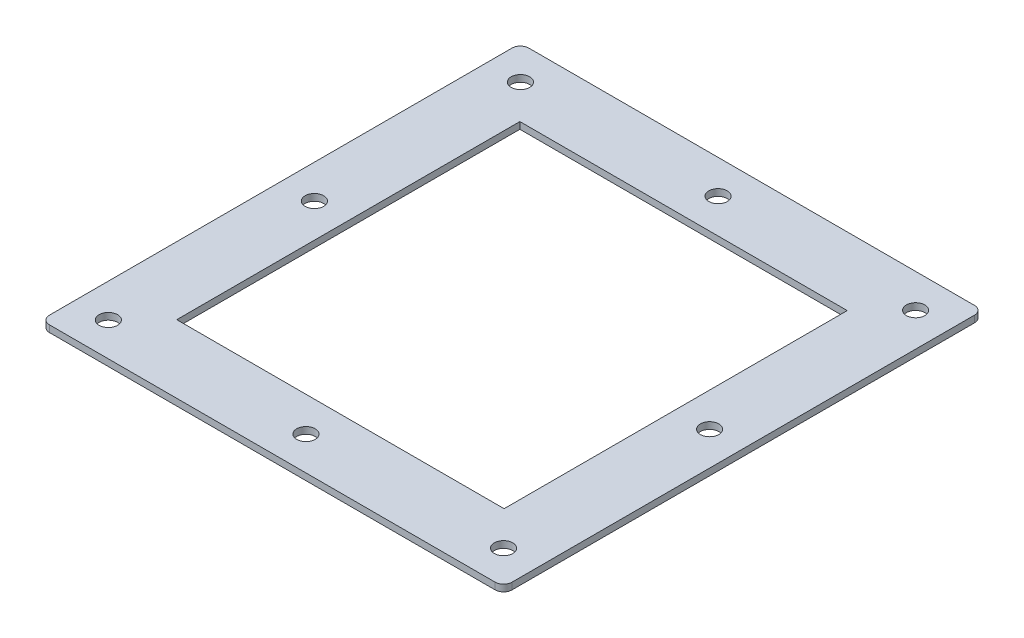
ISO-10303-21;
HEADER;
FILE_DESCRIPTION(('STEP AP214'),'2;1');
FILE_NAME('part.step','',(''),(''),'','','');
FILE_SCHEMA(('AUTOMOTIVE_DESIGN { 1 0 10303 214 1 1 1 1 }'));
ENDSEC;
DATA;
#1=APPLICATION_CONTEXT('core data for automotive mechanical design processes');
#2=APPLICATION_PROTOCOL_DEFINITION('international standard','automotive_design',2000,#1);
#3=PRODUCT_CONTEXT('',#1,'mechanical');
#4=PRODUCT('Part','Part','',(#3));
#5=PRODUCT_RELATED_PRODUCT_CATEGORY('part','',(#4));
#6=PRODUCT_DEFINITION_FORMATION('','',#4);
#7=PRODUCT_DEFINITION_CONTEXT('part definition',#1,'design');
#8=PRODUCT_DEFINITION('design','',#6,#7);
#9=PRODUCT_DEFINITION_SHAPE('','',#8);
#10=(LENGTH_UNIT() NAMED_UNIT(*) SI_UNIT(.MILLI.,.METRE.));
#11=(NAMED_UNIT(*) PLANE_ANGLE_UNIT() SI_UNIT($,.RADIAN.));
#12=(NAMED_UNIT(*) SI_UNIT($,.STERADIAN.) SOLID_ANGLE_UNIT());
#13=UNCERTAINTY_MEASURE_WITH_UNIT(LENGTH_MEASURE(1.E-05),#10,'distance_accuracy_value','');
#14=(GEOMETRIC_REPRESENTATION_CONTEXT(3) GLOBAL_UNCERTAINTY_ASSIGNED_CONTEXT((#13)) GLOBAL_UNIT_ASSIGNED_CONTEXT((#10,
#11,#12)) REPRESENTATION_CONTEXT('',''));
#15=CARTESIAN_POINT('',(0.,0.,0.));
#16=DIRECTION('',(0.,0.,1.));
#17=DIRECTION('',(1.,0.,0.));
#18=AXIS2_PLACEMENT_3D('',#15,#16,#17);
#19=CARTESIAN_POINT('',(-193.151037261948,344.875447906096,-102.00000000458));
#20=DIRECTION('',(0.,0.,1.));
#21=DIRECTION('',(1.,0.,0.));
#22=AXIS2_PLACEMENT_3D('',#19,#20,#21);
#23=PLANE('',#22);
#24=DIRECTION('',(0.,1.,0.));
#25=VECTOR('',#24,1.);
#26=CARTESIAN_POINT('',(-193.151037261948,344.875447906096,-102.00000000458));
#27=LINE('',#26,#25);
#28=CARTESIAN_POINT('',(-193.151037261948,340.875447906096,-102.00000000458));
#29=VERTEX_POINT('',#28);
#30=CARTESIAN_POINT('',(-193.151037261948,344.875447906096,-102.00000000458));
#31=VERTEX_POINT('',#30);
#32=EDGE_CURVE('E170',#29,#31,#27,.T.);
#33=ORIENTED_EDGE('',*,*,#32,.F.);
#34=DIRECTION('',(1.,0.,0.));
#35=VECTOR('',#34,1.);
#36=CARTESIAN_POINT('',(0.,340.875447906096,-102.00000000458));
#37=LINE('',#36,#35);
#38=CARTESIAN_POINT('',(1.49007185935127,340.875447906096,-102.00000000458));
#39=VERTEX_POINT('',#38);
#40=EDGE_CURVE('E216',#29,#39,#37,.T.);
#41=ORIENTED_EDGE('',*,*,#40,.T.);
#42=DIRECTION('',(0.,1.,0.));
#43=VECTOR('',#42,1.);
#44=CARTESIAN_POINT('',(1.49007185935127,344.875447906096,-102.00000000458));
#45=LINE('',#44,#43);
#46=CARTESIAN_POINT('',(1.49007185935127,344.875447906096,-102.00000000458));
#47=VERTEX_POINT('',#46);
#48=EDGE_CURVE('E233',#39,#47,#45,.T.);
#49=ORIENTED_EDGE('',*,*,#48,.T.);
#50=DIRECTION('',(1.,0.,0.));
#51=VECTOR('',#50,1.);
#52=CARTESIAN_POINT('',(-193.151037261948,344.875447906096,-102.00000000458));
#53=LINE('',#52,#51);
#54=EDGE_CURVE('E171',#31,#47,#53,.T.);
#55=ORIENTED_EDGE('',*,*,#54,.F.);
#56=EDGE_LOOP('',(#33,#41,#49,#55));
#57=FACE_BOUND('',#56,.T.);
#58=ADVANCED_FACE('F54',(#57),#23,.T.);
#59=CARTESIAN_POINT('',(1.49007185935127,344.875447906096,-102.00000000458));
#60=DIRECTION('',(-1.,0.,0.));
#61=DIRECTION('',(0.,0.,1.));
#62=AXIS2_PLACEMENT_3D('',#59,#60,#61);
#63=PLANE('',#62);
#64=ORIENTED_EDGE('',*,*,#48,.F.);
#65=DIRECTION('',(0.,0.,1.));
#66=VECTOR('',#65,1.);
#67=CARTESIAN_POINT('',(1.49007185935127,340.875447906096,0.));
#68=LINE('',#67,#66);
#69=CARTESIAN_POINT('',(1.49007185935125,340.875447906096,101.999999995405));
#70=VERTEX_POINT('',#69);
#71=EDGE_CURVE('E212',#39,#70,#68,.T.);
#72=ORIENTED_EDGE('',*,*,#71,.T.);
#73=DIRECTION('',(0.,1.,0.));
#74=VECTOR('',#73,1.);
#75=CARTESIAN_POINT('',(1.49007185935125,344.875447906096,101.999999995405));
#76=LINE('',#75,#74);
#77=CARTESIAN_POINT('',(1.49007185935125,344.875447906096,101.999999995405));
#78=VERTEX_POINT('',#77);
#79=EDGE_CURVE('E155',#70,#78,#76,.T.);
#80=ORIENTED_EDGE('',*,*,#79,.T.);
#81=DIRECTION('',(0.,0.,1.));
#82=VECTOR('',#81,1.);
#83=CARTESIAN_POINT('',(1.49007185935127,344.875447906096,-102.00000000458));
#84=LINE('',#83,#82);
#85=EDGE_CURVE('E166',#47,#78,#84,.T.);
#86=ORIENTED_EDGE('',*,*,#85,.F.);
#87=EDGE_LOOP('',(#64,#72,#80,#86));
#88=FACE_BOUND('',#87,.T.);
#89=ADVANCED_FACE('F347',(#88),#63,.T.);
#90=CARTESIAN_POINT('',(-193.151037261948,344.875447906096,101.999999995405));
#91=DIRECTION('',(0.,0.,-1.));
#92=DIRECTION('',(-1.,0.,0.));
#93=AXIS2_PLACEMENT_3D('',#90,#91,#92);
#94=PLANE('',#93);
#95=ORIENTED_EDGE('',*,*,#79,.F.);
#96=DIRECTION('',(1.,0.,0.));
#97=VECTOR('',#96,1.);
#98=CARTESIAN_POINT('',(0.,340.875447906096,101.999999995405));
#99=LINE('',#98,#97);
#100=CARTESIAN_POINT('',(-193.151037261948,340.875447906096,101.999999995405));
#101=VERTEX_POINT('',#100);
#102=EDGE_CURVE('E150',#70,#101,#99,.F.);
#103=ORIENTED_EDGE('',*,*,#102,.T.);
#104=DIRECTION('',(0.,1.,0.));
#105=VECTOR('',#104,1.);
#106=CARTESIAN_POINT('',(-193.151037261948,344.875447906096,101.999999995405));
#107=LINE('',#106,#105);
#108=CARTESIAN_POINT('',(-193.151037261948,344.875447906096,101.999999995405));
#109=VERTEX_POINT('',#108);
#110=EDGE_CURVE('E144',#101,#109,#107,.T.);
#111=ORIENTED_EDGE('',*,*,#110,.T.);
#112=DIRECTION('',(-1.,0.,0.));
#113=VECTOR('',#112,1.);
#114=CARTESIAN_POINT('',(-193.151037261948,344.875447906096,101.999999995405));
#115=LINE('',#114,#113);
#116=EDGE_CURVE('E147',#78,#109,#115,.T.);
#117=ORIENTED_EDGE('',*,*,#116,.F.);
#118=EDGE_LOOP('',(#95,#103,#111,#117));
#119=FACE_BOUND('',#118,.T.);
#120=ADVANCED_FACE('F146',(#119),#94,.T.);
#121=CARTESIAN_POINT('',(41.6685539095897,344.875447906096,-142.500000004577));
#122=DIRECTION('',(-1.,0.,0.));
#123=DIRECTION('',(0.,0.,1.));
#124=AXIS2_PLACEMENT_3D('',#121,#122,#123);
#125=PLANE('',#124);
#126=DIRECTION('',(0.,0.,1.));
#127=VECTOR('',#126,1.);
#128=CARTESIAN_POINT('',(41.6685539095897,340.875447906096,0.));
#129=LINE('',#128,#127);
#130=CARTESIAN_POINT('',(41.6685539095897,340.875447906096,-137.500000004577));
#131=VERTEX_POINT('',#130);
#132=CARTESIAN_POINT('',(41.6685539095897,340.875447906096,137.499999995401));
#133=VERTEX_POINT('',#132);
#134=EDGE_CURVE('E207',#131,#133,#129,.T.);
#135=ORIENTED_EDGE('',*,*,#134,.F.);
#136=DIRECTION('',(0.,-1.,0.));
#137=VECTOR('',#136,1.);
#138=CARTESIAN_POINT('',(41.6685539095897,344.875447906096,-137.500000004577));
#139=LINE('',#138,#137);
#140=CARTESIAN_POINT('',(41.6685539095897,344.875447906096,-137.500000004577));
#141=VERTEX_POINT('',#140);
#142=EDGE_CURVE('E263',#131,#141,#139,.F.);
#143=ORIENTED_EDGE('',*,*,#142,.T.);
#144=DIRECTION('',(0.,0.,1.));
#145=VECTOR('',#144,1.);
#146=CARTESIAN_POINT('',(41.6685539095897,344.875447906096,-142.500000004577));
#147=LINE('',#146,#145);
#148=CARTESIAN_POINT('',(41.6685539095897,344.875447906096,137.499999995401));
#149=VERTEX_POINT('',#148);
#150=EDGE_CURVE('E271',#141,#149,#147,.T.);
#151=ORIENTED_EDGE('',*,*,#150,.T.);
#152=DIRECTION('',(0.,-1.,0.));
#153=VECTOR('',#152,1.);
#154=CARTESIAN_POINT('',(41.6685539095897,344.875447906096,137.499999995401));
#155=LINE('',#154,#153);
#156=EDGE_CURVE('E261',#149,#133,#155,.T.);
#157=ORIENTED_EDGE('',*,*,#156,.T.);
#158=EDGE_LOOP('',(#135,#143,#151,#157));
#159=FACE_BOUND('',#158,.T.);
#160=ADVANCED_FACE('F270',(#159),#125,.F.);
#161=CARTESIAN_POINT('',(-233.32951931219,344.875447906096,-142.500000004577));
#162=DIRECTION('',(0.,0.,1.));
#163=DIRECTION('',(1.,0.,0.));
#164=AXIS2_PLACEMENT_3D('',#161,#162,#163);
#165=PLANE('',#164);
#166=DIRECTION('',(1.,0.,0.));
#167=VECTOR('',#166,1.);
#168=CARTESIAN_POINT('',(0.,340.875447906096,-142.500000004577));
#169=LINE('',#168,#167);
#170=CARTESIAN_POINT('',(-228.32951931219,340.875447906096,-142.500000004577));
#171=VERTEX_POINT('',#170);
#172=CARTESIAN_POINT('',(36.6685539095897,340.875447906096,-142.500000004577));
#173=VERTEX_POINT('',#172);
#174=EDGE_CURVE('E204',#171,#173,#169,.T.);
#175=ORIENTED_EDGE('',*,*,#174,.F.);
#176=DIRECTION('',(0.,-1.,0.));
#177=VECTOR('',#176,1.);
#178=CARTESIAN_POINT('',(-228.32951931219,344.875447906096,-142.500000004577));
#179=LINE('',#178,#177);
#180=CARTESIAN_POINT('',(-228.32951931219,344.875447906096,-142.500000004577));
#181=VERTEX_POINT('',#180);
#182=EDGE_CURVE('E238',#171,#181,#179,.F.);
#183=ORIENTED_EDGE('',*,*,#182,.T.);
#184=DIRECTION('',(1.,0.,0.));
#185=VECTOR('',#184,1.);
#186=CARTESIAN_POINT('',(-233.32951931219,344.875447906096,-142.500000004577));
#187=LINE('',#186,#185);
#188=CARTESIAN_POINT('',(36.6685539095897,344.875447906096,-142.500000004577));
#189=VERTEX_POINT('',#188);
#190=EDGE_CURVE('E167',#181,#189,#187,.T.);
#191=ORIENTED_EDGE('',*,*,#190,.T.);
#192=DIRECTION('',(0.,-1.,0.));
#193=VECTOR('',#192,1.);
#194=CARTESIAN_POINT('',(36.6685539095897,344.875447906096,-142.500000004577));
#195=LINE('',#194,#193);
#196=EDGE_CURVE('E235',#189,#173,#195,.T.);
#197=ORIENTED_EDGE('',*,*,#196,.T.);
#198=EDGE_LOOP('',(#175,#183,#191,#197));
#199=FACE_BOUND('',#198,.T.);
#200=ADVANCED_FACE('F397',(#199),#165,.F.);
#201=CARTESIAN_POINT('',(-233.32951931219,344.875447906096,-142.500000004577));
#202=DIRECTION('',(1.,0.,0.));
#203=DIRECTION('',(0.,0.,-1.));
#204=AXIS2_PLACEMENT_3D('',#201,#202,#203);
#205=PLANE('',#204);
#206=DIRECTION('',(0.,0.,-1.));
#207=VECTOR('',#206,1.);
#208=CARTESIAN_POINT('',(-233.32951931219,344.875447906096,-142.500000004577));
#209=LINE('',#208,#207);
#210=CARTESIAN_POINT('',(-233.32951931219,344.875447906096,137.499999995401));
#211=VERTEX_POINT('',#210);
#212=CARTESIAN_POINT('',(-233.32951931219,344.875447906096,-137.500000004577));
#213=VERTEX_POINT('',#212);
#214=EDGE_CURVE('E281',#211,#213,#209,.T.);
#215=ORIENTED_EDGE('',*,*,#214,.T.);
#216=DIRECTION('',(0.,-1.,0.));
#217=VECTOR('',#216,1.);
#218=CARTESIAN_POINT('',(-233.32951931219,344.875447906096,-137.500000004577));
#219=LINE('',#218,#217);
#220=CARTESIAN_POINT('',(-233.32951931219,340.875447906096,-137.500000004577));
#221=VERTEX_POINT('',#220);
#222=EDGE_CURVE('E252',#213,#221,#219,.T.);
#223=ORIENTED_EDGE('',*,*,#222,.T.);
#224=DIRECTION('',(0.,0.,1.));
#225=VECTOR('',#224,1.);
#226=CARTESIAN_POINT('',(-233.32951931219,340.875447906096,0.));
#227=LINE('',#226,#225);
#228=CARTESIAN_POINT('',(-233.32951931219,340.875447906096,137.499999995401));
#229=VERTEX_POINT('',#228);
#230=EDGE_CURVE('E200',#229,#221,#227,.F.);
#231=ORIENTED_EDGE('',*,*,#230,.F.);
#232=DIRECTION('',(0.,-1.,0.));
#233=VECTOR('',#232,1.);
#234=CARTESIAN_POINT('',(-233.32951931219,344.875447906096,137.499999995401));
#235=LINE('',#234,#233);
#236=EDGE_CURVE('E249',#229,#211,#235,.F.);
#237=ORIENTED_EDGE('',*,*,#236,.T.);
#238=EDGE_LOOP('',(#215,#223,#231,#237));
#239=FACE_BOUND('',#238,.T.);
#240=ADVANCED_FACE('F304',(#239),#205,.F.);
#241=CARTESIAN_POINT('',(-213.31468592695,344.875447906096,-4.58772950235777E-09));
#242=DIRECTION('',(0.,-1.,0.));
#243=DIRECTION('',(0.,0.,-1.));
#244=AXIS2_PLACEMENT_3D('',#241,#242,#243);
#245=CYLINDRICAL_SURFACE('',#244,5.49999999990337);
#246=CARTESIAN_POINT('',(-213.31468592695,344.875447906096,-4.58772950235777E-09));
#247=DIRECTION('',(0.,-1.,0.));
#248=DIRECTION('',(0.,0.,1.));
#249=AXIS2_PLACEMENT_3D('',#246,#247,#248);
#250=CIRCLE('',#249,5.49999999990337);
#251=CARTESIAN_POINT('',(-213.31468592695,344.875447906096,5.49999999531564));
#252=VERTEX_POINT('',#251);
#253=EDGE_CURVE('E231',#252,#252,#250,.T.);
#254=ORIENTED_EDGE('',*,*,#253,.F.);
#255=EDGE_LOOP('',(#254));
#256=FACE_BOUND('',#255,.T.);
#257=CARTESIAN_POINT('',(-213.31468592695,340.875447906096,-4.58772950235777E-09));
#258=DIRECTION('',(0.,-1.,0.));
#259=DIRECTION('',(0.,0.,-1.));
#260=AXIS2_PLACEMENT_3D('',#257,#258,#259);
#261=CIRCLE('',#260,5.49999999990337);
#262=CARTESIAN_POINT('',(-213.31468592695,340.875447906096,-5.5000000044911));
#263=VERTEX_POINT('',#262);
#264=EDGE_CURVE('E188',#263,#263,#261,.T.);
#265=ORIENTED_EDGE('',*,*,#264,.T.);
#266=EDGE_LOOP('',(#265));
#267=FACE_BOUND('',#266,.T.);
#268=ADVANCED_FACE('F300',(#256,#267),#245,.F.);
#269=CARTESIAN_POINT('',(-213.31468592695,344.875447906096,122.499999995837));
#270=DIRECTION('',(0.,-1.,0.));
#271=DIRECTION('',(0.,0.,-1.));
#272=AXIS2_PLACEMENT_3D('',#269,#270,#271);
#273=CYLINDRICAL_SURFACE('',#272,5.49999999990332);
#274=CARTESIAN_POINT('',(-213.31468592695,344.875447906096,122.499999995837));
#275=DIRECTION('',(0.,-1.,0.));
#276=DIRECTION('',(0.,0.,1.));
#277=AXIS2_PLACEMENT_3D('',#274,#275,#276);
#278=CIRCLE('',#277,5.49999999990332);
#279=CARTESIAN_POINT('',(-213.31468592695,344.875447906096,127.99999999574));
#280=VERTEX_POINT('',#279);
#281=EDGE_CURVE('E292',#280,#280,#278,.T.);
#282=ORIENTED_EDGE('',*,*,#281,.F.);
#283=EDGE_LOOP('',(#282));
#284=FACE_BOUND('',#283,.T.);
#285=CARTESIAN_POINT('',(-213.31468592695,340.875447906096,122.499999995837));
#286=DIRECTION('',(0.,-1.,0.));
#287=DIRECTION('',(0.,0.,-1.));
#288=AXIS2_PLACEMENT_3D('',#285,#286,#287);
#289=CIRCLE('',#288,5.49999999990332);
#290=CARTESIAN_POINT('',(-213.31468592695,340.875447906096,116.999999995934));
#291=VERTEX_POINT('',#290);
#292=EDGE_CURVE('E191',#291,#291,#289,.T.);
#293=ORIENTED_EDGE('',*,*,#292,.T.);
#294=EDGE_LOOP('',(#293));
#295=FACE_BOUND('',#294,.T.);
#296=ADVANCED_FACE('F303',(#284,#295),#273,.F.);
#297=CARTESIAN_POINT('',(21.6537205243498,344.875447906096,-4.58770072702709E-09));
#298=DIRECTION('',(0.,-1.,0.));
#299=DIRECTION('',(0.,0.,-1.));
#300=AXIS2_PLACEMENT_3D('',#297,#298,#299);
#301=CYLINDRICAL_SURFACE('',#300,5.49999999990341);
#302=CARTESIAN_POINT('',(21.6537205243498,344.875447906096,-4.58770072702709E-09));
#303=DIRECTION('',(0.,-1.,0.));
#304=DIRECTION('',(0.,0.,-1.));
#305=AXIS2_PLACEMENT_3D('',#302,#303,#304);
#306=CIRCLE('',#305,5.49999999990341);
#307=CARTESIAN_POINT('',(21.6537205243498,344.875447906096,-5.50000000449111));
#308=VERTEX_POINT('',#307);
#309=EDGE_CURVE('E289',#308,#308,#306,.T.);
#310=ORIENTED_EDGE('',*,*,#309,.F.);
#311=EDGE_LOOP('',(#310));
#312=FACE_BOUND('',#311,.T.);
#313=CARTESIAN_POINT('',(21.6537205243498,340.875447906096,-4.58770072702709E-09));
#314=DIRECTION('',(0.,-1.,0.));
#315=DIRECTION('',(0.,0.,-1.));
#316=AXIS2_PLACEMENT_3D('',#313,#314,#315);
#317=CIRCLE('',#316,5.49999999990341);
#318=CARTESIAN_POINT('',(21.6537205243498,340.875447906096,-5.50000000449111));
#319=VERTEX_POINT('',#318);
#320=EDGE_CURVE('E194',#319,#319,#317,.T.);
#321=ORIENTED_EDGE('',*,*,#320,.T.);
#322=EDGE_LOOP('',(#321));
#323=FACE_BOUND('',#322,.T.);
#324=ADVANCED_FACE('F554',(#312,#323),#301,.F.);
#325=CARTESIAN_POINT('',(-213.31468592695,344.875447906096,-122.500000005012));
#326=DIRECTION('',(0.,-1.,0.));
#327=DIRECTION('',(0.,0.,-1.));
#328=AXIS2_PLACEMENT_3D('',#325,#326,#327);
#329=CYLINDRICAL_SURFACE('',#328,5.49999999990338);
#330=CARTESIAN_POINT('',(-213.31468592695,344.875447906096,-122.500000005012));
#331=DIRECTION('',(0.,-1.,0.));
#332=DIRECTION('',(0.,0.,-1.));
#333=AXIS2_PLACEMENT_3D('',#330,#331,#332);
#334=CIRCLE('',#333,5.49999999990338);
#335=CARTESIAN_POINT('',(-213.31468592695,344.875447906096,-128.000000004916));
#336=VERTEX_POINT('',#335);
#337=EDGE_CURVE('E286',#336,#336,#334,.T.);
#338=ORIENTED_EDGE('',*,*,#337,.F.);
#339=EDGE_LOOP('',(#338));
#340=FACE_BOUND('',#339,.T.);
#341=CARTESIAN_POINT('',(-213.31468592695,340.875447906096,-122.500000005012));
#342=DIRECTION('',(0.,-1.,0.));
#343=DIRECTION('',(0.,0.,-1.));
#344=AXIS2_PLACEMENT_3D('',#341,#342,#343);
#345=CIRCLE('',#344,5.49999999990338);
#346=CARTESIAN_POINT('',(-213.31468592695,340.875447906096,-128.000000004916));
#347=VERTEX_POINT('',#346);
#348=EDGE_CURVE('E197',#347,#347,#345,.T.);
#349=ORIENTED_EDGE('',*,*,#348,.T.);
#350=EDGE_LOOP('',(#349));
#351=FACE_BOUND('',#350,.T.);
#352=ADVANCED_FACE('F430',(#340,#351),#329,.F.);
#353=CARTESIAN_POINT('',(-233.32951931219,344.875447906096,142.499999995401));
#354=DIRECTION('',(0.,0.,-1.));
#355=DIRECTION('',(-1.,0.,0.));
#356=AXIS2_PLACEMENT_3D('',#353,#354,#355);
#357=PLANE('',#356);
#358=DIRECTION('',(1.,0.,0.));
#359=VECTOR('',#358,1.);
#360=CARTESIAN_POINT('',(0.,340.875447906096,142.499999995401));
#361=LINE('',#360,#359);
#362=CARTESIAN_POINT('',(36.6685539095897,340.875447906096,142.499999995401));
#363=VERTEX_POINT('',#362);
#364=CARTESIAN_POINT('',(-228.32951931219,340.875447906096,142.499999995401));
#365=VERTEX_POINT('',#364);
#366=EDGE_CURVE('E203',#363,#365,#361,.F.);
#367=ORIENTED_EDGE('',*,*,#366,.F.);
#368=DIRECTION('',(0.,-1.,0.));
#369=VECTOR('',#368,1.);
#370=CARTESIAN_POINT('',(36.6685539095897,344.875447906096,142.499999995401));
#371=LINE('',#370,#369);
#372=CARTESIAN_POINT('',(36.6685539095897,344.875447906096,142.499999995401));
#373=VERTEX_POINT('',#372);
#374=EDGE_CURVE('E13',#363,#373,#371,.F.);
#375=ORIENTED_EDGE('',*,*,#374,.T.);
#376=DIRECTION('',(-1.,0.,0.));
#377=VECTOR('',#376,1.);
#378=CARTESIAN_POINT('',(-233.32951931219,344.875447906096,142.499999995401));
#379=LINE('',#378,#377);
#380=CARTESIAN_POINT('',(-228.32951931219,344.875447906096,142.499999995401));
#381=VERTEX_POINT('',#380);
#382=EDGE_CURVE('E279',#373,#381,#379,.T.);
#383=ORIENTED_EDGE('',*,*,#382,.T.);
#384=DIRECTION('',(0.,-1.,0.));
#385=VECTOR('',#384,1.);
#386=CARTESIAN_POINT('',(-228.32951931219,344.875447906096,142.499999995401));
#387=LINE('',#386,#385);
#388=EDGE_CURVE('E62',#381,#365,#387,.T.);
#389=ORIENTED_EDGE('',*,*,#388,.T.);
#390=EDGE_LOOP('',(#367,#375,#383,#389));
#391=FACE_BOUND('',#390,.T.);
#392=ADVANCED_FACE('F360',(#391),#357,.F.);
#393=CARTESIAN_POINT('',(-193.151037261948,344.875447906096,-102.00000000458));
#394=DIRECTION('',(1.,0.,0.));
#395=DIRECTION('',(0.,0.,-1.));
#396=AXIS2_PLACEMENT_3D('',#393,#394,#395);
#397=PLANE('',#396);
#398=DIRECTION('',(0.,0.,1.));
#399=VECTOR('',#398,1.);
#400=CARTESIAN_POINT('',(-193.151037261948,340.875447906096,0.));
#401=LINE('',#400,#399);
#402=EDGE_CURVE('E211',#101,#29,#401,.F.);
#403=ORIENTED_EDGE('',*,*,#402,.T.);
#404=ORIENTED_EDGE('',*,*,#32,.T.);
#405=DIRECTION('',(0.,0.,-1.));
#406=VECTOR('',#405,1.);
#407=CARTESIAN_POINT('',(-193.151037261948,344.875447906096,-102.00000000458));
#408=LINE('',#407,#406);
#409=EDGE_CURVE('E163',#109,#31,#408,.T.);
#410=ORIENTED_EDGE('',*,*,#409,.F.);
#411=ORIENTED_EDGE('',*,*,#110,.F.);
#412=EDGE_LOOP('',(#403,#404,#410,#411));
#413=FACE_BOUND('',#412,.T.);
#414=ADVANCED_FACE('F169',(#413),#397,.T.);
#415=CARTESIAN_POINT('',(-95.8304827013002,344.875447906096,-122.500000005012));
#416=DIRECTION('',(0.,-1.,0.));
#417=DIRECTION('',(0.,0.,-1.));
#418=AXIS2_PLACEMENT_3D('',#415,#416,#417);
#419=CYLINDRICAL_SURFACE('',#418,5.49999999965237);
#420=CARTESIAN_POINT('',(-95.8304827013002,344.875447906096,-122.500000005012));
#421=DIRECTION('',(0.,-1.,0.));
#422=DIRECTION('',(0.,0.,-1.));
#423=AXIS2_PLACEMENT_3D('',#420,#421,#422);
#424=CIRCLE('',#423,5.49999999965237);
#425=CARTESIAN_POINT('',(-95.8304827013002,344.875447906096,-128.000000004665));
#426=VERTEX_POINT('',#425);
#427=EDGE_CURVE('E177',#426,#426,#424,.T.);
#428=ORIENTED_EDGE('',*,*,#427,.F.);
#429=EDGE_LOOP('',(#428));
#430=FACE_BOUND('',#429,.T.);
#431=CARTESIAN_POINT('',(-95.8304827013002,340.875447906096,-122.500000005012));
#432=DIRECTION('',(0.,-1.,0.));
#433=DIRECTION('',(0.,0.,-1.));
#434=AXIS2_PLACEMENT_3D('',#431,#432,#433);
#435=CIRCLE('',#434,5.49999999965237);
#436=CARTESIAN_POINT('',(-95.8304827013002,340.875447906096,-128.000000004665));
#437=VERTEX_POINT('',#436);
#438=EDGE_CURVE('E215',#437,#437,#435,.T.);
#439=ORIENTED_EDGE('',*,*,#438,.T.);
#440=EDGE_LOOP('',(#439));
#441=FACE_BOUND('',#440,.T.);
#442=ADVANCED_FACE('F359',(#430,#441),#419,.F.);
#443=CARTESIAN_POINT('',(-95.8304827013002,344.875447906096,122.499999995837));
#444=DIRECTION('',(0.,-1.,0.));
#445=DIRECTION('',(0.,0.,-1.));
#446=AXIS2_PLACEMENT_3D('',#443,#444,#445);
#447=CYLINDRICAL_SURFACE('',#446,5.50000000015439);
#448=CARTESIAN_POINT('',(-95.8304827013002,344.875447906096,122.499999995837));
#449=DIRECTION('',(0.,-1.,0.));
#450=DIRECTION('',(0.,0.,1.));
#451=AXIS2_PLACEMENT_3D('',#448,#449,#450);
#452=CIRCLE('',#451,5.50000000015439);
#453=CARTESIAN_POINT('',(-95.8304827013002,344.875447906096,127.999999995991));
#454=VERTEX_POINT('',#453);
#455=EDGE_CURVE('E180',#454,#454,#452,.T.);
#456=ORIENTED_EDGE('',*,*,#455,.F.);
#457=EDGE_LOOP('',(#456));
#458=FACE_BOUND('',#457,.T.);
#459=CARTESIAN_POINT('',(-95.8304827013002,340.875447906096,122.499999995837));
#460=DIRECTION('',(0.,-1.,0.));
#461=DIRECTION('',(0.,0.,-1.));
#462=AXIS2_PLACEMENT_3D('',#459,#460,#461);
#463=CIRCLE('',#462,5.50000000015439);
#464=CARTESIAN_POINT('',(-95.8304827013002,340.875447906096,116.999999995683));
#465=VERTEX_POINT('',#464);
#466=EDGE_CURVE('E222',#465,#465,#463,.T.);
#467=ORIENTED_EDGE('',*,*,#466,.T.);
#468=EDGE_LOOP('',(#467));
#469=FACE_BOUND('',#468,.T.);
#470=ADVANCED_FACE('F341',(#458,#469),#447,.F.);
#471=CARTESIAN_POINT('',(21.6537205243498,344.875447906096,122.499999995837));
#472=DIRECTION('',(0.,-1.,0.));
#473=DIRECTION('',(0.,0.,-1.));
#474=AXIS2_PLACEMENT_3D('',#471,#472,#473);
#475=CYLINDRICAL_SURFACE('',#474,5.49999999990338);
#476=CARTESIAN_POINT('',(21.6537205243498,344.875447906096,122.499999995837));
#477=DIRECTION('',(0.,-1.,0.));
#478=DIRECTION('',(0.,0.,-1.));
#479=AXIS2_PLACEMENT_3D('',#476,#477,#478);
#480=CIRCLE('',#479,5.49999999990338);
#481=CARTESIAN_POINT('',(21.6537205243498,344.875447906096,116.999999995934));
#482=VERTEX_POINT('',#481);
#483=EDGE_CURVE('E183',#482,#482,#480,.T.);
#484=ORIENTED_EDGE('',*,*,#483,.F.);
#485=EDGE_LOOP('',(#484));
#486=FACE_BOUND('',#485,.T.);
#487=CARTESIAN_POINT('',(21.6537205243498,340.875447906096,122.499999995837));
#488=DIRECTION('',(0.,-1.,0.));
#489=DIRECTION('',(0.,0.,-1.));
#490=AXIS2_PLACEMENT_3D('',#487,#488,#489);
#491=CIRCLE('',#490,5.49999999990338);
#492=CARTESIAN_POINT('',(21.6537205243498,340.875447906096,116.999999995934));
#493=VERTEX_POINT('',#492);
#494=EDGE_CURVE('E225',#493,#493,#491,.T.);
#495=ORIENTED_EDGE('',*,*,#494,.T.);
#496=EDGE_LOOP('',(#495));
#497=FACE_BOUND('',#496,.T.);
#498=ADVANCED_FACE('F333',(#486,#497),#475,.F.);
#499=CARTESIAN_POINT('',(21.6537205243498,344.875447906096,-122.500000005012));
#500=DIRECTION('',(0.,-1.,0.));
#501=DIRECTION('',(0.,0.,-1.));
#502=AXIS2_PLACEMENT_3D('',#499,#500,#501);
#503=CYLINDRICAL_SURFACE('',#502,5.49999999990341);
#504=CARTESIAN_POINT('',(21.6537205243498,344.875447906096,-122.500000005012));
#505=DIRECTION('',(0.,-1.,0.));
#506=DIRECTION('',(0.,0.,1.));
#507=AXIS2_PLACEMENT_3D('',#504,#505,#506);
#508=CIRCLE('',#507,5.49999999990341);
#509=CARTESIAN_POINT('',(21.6537205243498,344.875447906096,-117.000000005109));
#510=VERTEX_POINT('',#509);
#511=EDGE_CURVE('E156',#510,#510,#508,.T.);
#512=ORIENTED_EDGE('',*,*,#511,.F.);
#513=EDGE_LOOP('',(#512));
#514=FACE_BOUND('',#513,.T.);
#515=CARTESIAN_POINT('',(21.6537205243498,340.875447906096,-122.500000005012));
#516=DIRECTION('',(0.,-1.,0.));
#517=DIRECTION('',(0.,0.,-1.));
#518=AXIS2_PLACEMENT_3D('',#515,#516,#517);
#519=CIRCLE('',#518,5.49999999990341);
#520=CARTESIAN_POINT('',(21.6537205243498,340.875447906096,-128.000000004916));
#521=VERTEX_POINT('',#520);
#522=EDGE_CURVE('E228',#521,#521,#519,.T.);
#523=ORIENTED_EDGE('',*,*,#522,.T.);
#524=EDGE_LOOP('',(#523));
#525=FACE_BOUND('',#524,.T.);
#526=ADVANCED_FACE('F331',(#514,#525),#503,.F.);
#527=CARTESIAN_POINT('',(0.,344.875447906096,0.));
#528=DIRECTION('',(0.,1.,0.));
#529=DIRECTION('',(0.,0.,1.));
#530=AXIS2_PLACEMENT_3D('',#527,#528,#529);
#531=PLANE('',#530);
#532=ORIENTED_EDGE('',*,*,#253,.T.);
#533=EDGE_LOOP('',(#532));
#534=FACE_BOUND('',#533,.T.);
#535=ORIENTED_EDGE('',*,*,#281,.T.);
#536=EDGE_LOOP('',(#535));
#537=FACE_BOUND('',#536,.T.);
#538=ORIENTED_EDGE('',*,*,#309,.T.);
#539=EDGE_LOOP('',(#538));
#540=FACE_BOUND('',#539,.T.);
#541=ORIENTED_EDGE('',*,*,#337,.T.);
#542=EDGE_LOOP('',(#541));
#543=FACE_BOUND('',#542,.T.);
#544=ORIENTED_EDGE('',*,*,#190,.F.);
#545=CARTESIAN_POINT('',(-228.32951931219,344.875447906096,-137.500000004577));
#546=DIRECTION('',(0.,1.,0.));
#547=DIRECTION('',(0.,0.,1.));
#548=AXIS2_PLACEMENT_3D('',#545,#546,#547);
#549=CIRCLE('',#548,5.);
#550=EDGE_CURVE('E247',#181,#213,#549,.T.);
#551=ORIENTED_EDGE('',*,*,#550,.T.);
#552=ORIENTED_EDGE('',*,*,#214,.F.);
#553=CARTESIAN_POINT('',(-228.32951931219,344.875447906096,137.499999995401));
#554=DIRECTION('',(0.,1.,0.));
#555=DIRECTION('',(0.,0.,1.));
#556=AXIS2_PLACEMENT_3D('',#553,#554,#555);
#557=CIRCLE('',#556,5.);
#558=EDGE_CURVE('E241',#211,#381,#557,.T.);
#559=ORIENTED_EDGE('',*,*,#558,.T.);
#560=ORIENTED_EDGE('',*,*,#382,.F.);
#561=CARTESIAN_POINT('',(36.6685539095897,344.875447906096,137.499999995401));
#562=DIRECTION('',(0.,1.,0.));
#563=DIRECTION('',(0.,0.,1.));
#564=AXIS2_PLACEMENT_3D('',#561,#562,#563);
#565=CIRCLE('',#564,5.);
#566=EDGE_CURVE('E243',#373,#149,#565,.T.);
#567=ORIENTED_EDGE('',*,*,#566,.T.);
#568=ORIENTED_EDGE('',*,*,#150,.F.);
#569=CARTESIAN_POINT('',(36.6685539095897,344.875447906096,-137.500000004577));
#570=DIRECTION('',(0.,1.,0.));
#571=DIRECTION('',(0.,0.,1.));
#572=AXIS2_PLACEMENT_3D('',#569,#570,#571);
#573=CIRCLE('',#572,5.);
#574=EDGE_CURVE('E245',#141,#189,#573,.T.);
#575=ORIENTED_EDGE('',*,*,#574,.T.);
#576=EDGE_LOOP('',(#544,#551,#552,#559,#560,#567,#568,#575));
#577=FACE_BOUND('',#576,.T.);
#578=ORIENTED_EDGE('',*,*,#116,.T.);
#579=ORIENTED_EDGE('',*,*,#409,.T.);
#580=ORIENTED_EDGE('',*,*,#54,.T.);
#581=ORIENTED_EDGE('',*,*,#85,.T.);
#582=EDGE_LOOP('',(#578,#579,#580,#581));
#583=FACE_BOUND('',#582,.T.);
#584=ORIENTED_EDGE('',*,*,#427,.T.);
#585=EDGE_LOOP('',(#584));
#586=FACE_BOUND('',#585,.T.);
#587=ORIENTED_EDGE('',*,*,#455,.T.);
#588=EDGE_LOOP('',(#587));
#589=FACE_BOUND('',#588,.T.);
#590=ORIENTED_EDGE('',*,*,#483,.T.);
#591=EDGE_LOOP('',(#590));
#592=FACE_BOUND('',#591,.T.);
#593=ORIENTED_EDGE('',*,*,#511,.T.);
#594=EDGE_LOOP('',(#593));
#595=FACE_BOUND('',#594,.T.);
#596=ADVANCED_FACE('F160',(#534,#537,#540,#543,#577,#583,#586,#589,#592,#595),#531,.T.);
#597=CARTESIAN_POINT('',(0.,340.875447906096,0.));
#598=DIRECTION('',(0.,1.,0.));
#599=DIRECTION('',(0.,0.,1.));
#600=AXIS2_PLACEMENT_3D('',#597,#598,#599);
#601=PLANE('',#600);
#602=ORIENTED_EDGE('',*,*,#264,.F.);
#603=EDGE_LOOP('',(#602));
#604=FACE_BOUND('',#603,.T.);
#605=ORIENTED_EDGE('',*,*,#292,.F.);
#606=EDGE_LOOP('',(#605));
#607=FACE_BOUND('',#606,.T.);
#608=ORIENTED_EDGE('',*,*,#320,.F.);
#609=EDGE_LOOP('',(#608));
#610=FACE_BOUND('',#609,.T.);
#611=ORIENTED_EDGE('',*,*,#348,.F.);
#612=EDGE_LOOP('',(#611));
#613=FACE_BOUND('',#612,.T.);
#614=ORIENTED_EDGE('',*,*,#230,.T.);
#615=CARTESIAN_POINT('',(-228.32951931219,340.875447906096,-137.500000004577));
#616=DIRECTION('',(0.,1.,0.));
#617=DIRECTION('',(0.,0.,1.));
#618=AXIS2_PLACEMENT_3D('',#615,#616,#617);
#619=CIRCLE('',#618,5.);
#620=EDGE_CURVE('E259',#221,#171,#619,.F.);
#621=ORIENTED_EDGE('',*,*,#620,.T.);
#622=ORIENTED_EDGE('',*,*,#174,.T.);
#623=CARTESIAN_POINT('',(36.6685539095897,340.875447906096,-137.500000004577));
#624=DIRECTION('',(0.,1.,0.));
#625=DIRECTION('',(0.,0.,1.));
#626=AXIS2_PLACEMENT_3D('',#623,#624,#625);
#627=CIRCLE('',#626,5.);
#628=EDGE_CURVE('E257',#173,#131,#627,.F.);
#629=ORIENTED_EDGE('',*,*,#628,.T.);
#630=ORIENTED_EDGE('',*,*,#134,.T.);
#631=CARTESIAN_POINT('',(36.6685539095897,340.875447906096,137.499999995401));
#632=DIRECTION('',(0.,1.,0.));
#633=DIRECTION('',(0.,0.,1.));
#634=AXIS2_PLACEMENT_3D('',#631,#632,#633);
#635=CIRCLE('',#634,5.);
#636=EDGE_CURVE('E75',#133,#363,#635,.F.);
#637=ORIENTED_EDGE('',*,*,#636,.T.);
#638=ORIENTED_EDGE('',*,*,#366,.T.);
#639=CARTESIAN_POINT('',(-228.32951931219,340.875447906096,137.499999995401));
#640=DIRECTION('',(0.,1.,0.));
#641=DIRECTION('',(0.,0.,1.));
#642=AXIS2_PLACEMENT_3D('',#639,#640,#641);
#643=CIRCLE('',#642,5.);
#644=EDGE_CURVE('E254',#365,#229,#643,.F.);
#645=ORIENTED_EDGE('',*,*,#644,.T.);
#646=EDGE_LOOP('',(#614,#621,#622,#629,#630,#637,#638,#645));
#647=FACE_BOUND('',#646,.T.);
#648=ORIENTED_EDGE('',*,*,#102,.F.);
#649=ORIENTED_EDGE('',*,*,#71,.F.);
#650=ORIENTED_EDGE('',*,*,#40,.F.);
#651=ORIENTED_EDGE('',*,*,#402,.F.);
#652=EDGE_LOOP('',(#648,#649,#650,#651));
#653=FACE_BOUND('',#652,.T.);
#654=ORIENTED_EDGE('',*,*,#438,.F.);
#655=EDGE_LOOP('',(#654));
#656=FACE_BOUND('',#655,.T.);
#657=ORIENTED_EDGE('',*,*,#466,.F.);
#658=EDGE_LOOP('',(#657));
#659=FACE_BOUND('',#658,.T.);
#660=ORIENTED_EDGE('',*,*,#494,.F.);
#661=EDGE_LOOP('',(#660));
#662=FACE_BOUND('',#661,.T.);
#663=ORIENTED_EDGE('',*,*,#522,.F.);
#664=EDGE_LOOP('',(#663));
#665=FACE_BOUND('',#664,.T.);
#666=ADVANCED_FACE('F308',(#604,#607,#610,#613,#647,#653,#656,#659,#662,#665),#601,.F.);
#667=CARTESIAN_POINT('',(-228.32951931219,344.875447906096,-137.500000004577));
#668=DIRECTION('',(0.,1.,0.));
#669=DIRECTION('',(0.,0.,1.));
#670=AXIS2_PLACEMENT_3D('',#667,#668,#669);
#671=CYLINDRICAL_SURFACE('',#670,5.);
#672=ORIENTED_EDGE('',*,*,#620,.F.);
#673=ORIENTED_EDGE('',*,*,#222,.F.);
#674=ORIENTED_EDGE('',*,*,#550,.F.);
#675=ORIENTED_EDGE('',*,*,#182,.F.);
#676=EDGE_LOOP('',(#672,#673,#674,#675));
#677=FACE_BOUND('',#676,.T.);
#678=ADVANCED_FACE('F311',(#677),#671,.T.);
#679=CARTESIAN_POINT('',(36.6685539095897,344.875447906096,-137.500000004577));
#680=DIRECTION('',(0.,1.,0.));
#681=DIRECTION('',(0.,0.,1.));
#682=AXIS2_PLACEMENT_3D('',#679,#680,#681);
#683=CYLINDRICAL_SURFACE('',#682,5.);
#684=ORIENTED_EDGE('',*,*,#628,.F.);
#685=ORIENTED_EDGE('',*,*,#196,.F.);
#686=ORIENTED_EDGE('',*,*,#574,.F.);
#687=ORIENTED_EDGE('',*,*,#142,.F.);
#688=EDGE_LOOP('',(#684,#685,#686,#687));
#689=FACE_BOUND('',#688,.T.);
#690=ADVANCED_FACE('F456',(#689),#683,.T.);
#691=CARTESIAN_POINT('',(36.6685539095897,344.875447906096,137.499999995401));
#692=DIRECTION('',(0.,1.,0.));
#693=DIRECTION('',(0.,0.,1.));
#694=AXIS2_PLACEMENT_3D('',#691,#692,#693);
#695=CYLINDRICAL_SURFACE('',#694,5.);
#696=ORIENTED_EDGE('',*,*,#636,.F.);
#697=ORIENTED_EDGE('',*,*,#156,.F.);
#698=ORIENTED_EDGE('',*,*,#566,.F.);
#699=ORIENTED_EDGE('',*,*,#374,.F.);
#700=EDGE_LOOP('',(#696,#697,#698,#699));
#701=FACE_BOUND('',#700,.T.);
#702=ADVANCED_FACE('F466',(#701),#695,.T.);
#703=CARTESIAN_POINT('',(-228.32951931219,344.875447906096,137.499999995401));
#704=DIRECTION('',(0.,1.,0.));
#705=DIRECTION('',(0.,0.,1.));
#706=AXIS2_PLACEMENT_3D('',#703,#704,#705);
#707=CYLINDRICAL_SURFACE('',#706,5.);
#708=ORIENTED_EDGE('',*,*,#644,.F.);
#709=ORIENTED_EDGE('',*,*,#388,.F.);
#710=ORIENTED_EDGE('',*,*,#558,.F.);
#711=ORIENTED_EDGE('',*,*,#236,.F.);
#712=EDGE_LOOP('',(#708,#709,#710,#711));
#713=FACE_BOUND('',#712,.T.);
#714=ADVANCED_FACE('F56',(#713),#707,.T.);
#715=CLOSED_SHELL('',(#58,#89,#120,#160,#200,#240,#268,#296,#324,#352,#392,#414,#442,#470,#498,
#526,#596,#666,#678,#690,#702,#714));
#716=MANIFOLD_SOLID_BREP('B2',#715);
#717=ADVANCED_BREP_SHAPE_REPRESENTATION('',(#18,#716),#14);
#718=SHAPE_DEFINITION_REPRESENTATION(#9,#717);
ENDSEC;
END-ISO-10303-21;
